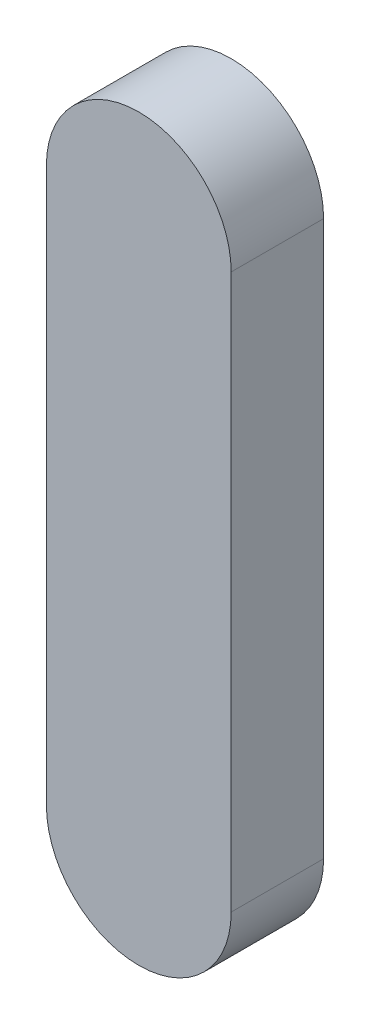
ISO-10303-21;
HEADER;
FILE_DESCRIPTION(('STEP AP214'),'2;1');
FILE_NAME('part.step','',(''),(''),'','','');
FILE_SCHEMA(('AUTOMOTIVE_DESIGN { 1 0 10303 214 1 1 1 1 }'));
ENDSEC;
DATA;
#1=APPLICATION_CONTEXT('core data for automotive mechanical design processes');
#2=APPLICATION_PROTOCOL_DEFINITION('international standard','automotive_design',2000,#1);
#3=PRODUCT_CONTEXT('',#1,'mechanical');
#4=PRODUCT('Part','Part','',(#3));
#5=PRODUCT_RELATED_PRODUCT_CATEGORY('part','',(#4));
#6=PRODUCT_DEFINITION_FORMATION('','',#4);
#7=PRODUCT_DEFINITION_CONTEXT('part definition',#1,'design');
#8=PRODUCT_DEFINITION('design','',#6,#7);
#9=PRODUCT_DEFINITION_SHAPE('','',#8);
#10=(LENGTH_UNIT() NAMED_UNIT(*) SI_UNIT(.MILLI.,.METRE.));
#11=(NAMED_UNIT(*) PLANE_ANGLE_UNIT() SI_UNIT($,.RADIAN.));
#12=(NAMED_UNIT(*) SI_UNIT($,.STERADIAN.) SOLID_ANGLE_UNIT());
#13=UNCERTAINTY_MEASURE_WITH_UNIT(LENGTH_MEASURE(1.E-05),#10,'distance_accuracy_value','');
#14=(GEOMETRIC_REPRESENTATION_CONTEXT(3) GLOBAL_UNCERTAINTY_ASSIGNED_CONTEXT((#13)) GLOBAL_UNIT_ASSIGNED_CONTEXT((#10,
#11,#12)) REPRESENTATION_CONTEXT('',''));
#15=CARTESIAN_POINT('',(0.,0.,0.));
#16=DIRECTION('',(0.,0.,1.));
#17=DIRECTION('',(1.,0.,0.));
#18=AXIS2_PLACEMENT_3D('',#15,#16,#17);
#19=CARTESIAN_POINT('',(0.,0.,5.));
#20=DIRECTION('',(0.,0.,-1.));
#21=DIRECTION('',(-1.,0.,0.));
#22=AXIS2_PLACEMENT_3D('',#19,#20,#21);
#23=CYLINDRICAL_SURFACE('',#22,5.);
#24=CARTESIAN_POINT('',(0.,0.,0.));
#25=DIRECTION('',(0.,0.,1.));
#26=DIRECTION('',(1.,0.,0.));
#27=AXIS2_PLACEMENT_3D('',#24,#25,#26);
#28=CIRCLE('',#27,5.);
#29=CARTESIAN_POINT('',(5.,0.,0.));
#30=VERTEX_POINT('',#29);
#31=CARTESIAN_POINT('',(-5.,0.,0.));
#32=VERTEX_POINT('',#31);
#33=EDGE_CURVE('E107',#30,#32,#28,.T.);
#34=ORIENTED_EDGE('',*,*,#33,.T.);
#35=DIRECTION('',(0.,0.,-1.));
#36=VECTOR('',#35,1.);
#37=CARTESIAN_POINT('',(-5.,0.,5.));
#38=LINE('',#37,#36);
#39=CARTESIAN_POINT('',(-5.,0.,5.));
#40=VERTEX_POINT('',#39);
#41=EDGE_CURVE('E11',#40,#32,#38,.T.);
#42=ORIENTED_EDGE('',*,*,#41,.F.);
#43=CARTESIAN_POINT('',(0.,0.,5.));
#44=DIRECTION('',(0.,0.,1.));
#45=DIRECTION('',(1.,0.,0.));
#46=AXIS2_PLACEMENT_3D('',#43,#44,#45);
#47=CIRCLE('',#46,5.);
#48=CARTESIAN_POINT('',(5.,0.,5.));
#49=VERTEX_POINT('',#48);
#50=EDGE_CURVE('E91',#49,#40,#47,.T.);
#51=ORIENTED_EDGE('',*,*,#50,.F.);
#52=DIRECTION('',(0.,0.,-1.));
#53=VECTOR('',#52,1.);
#54=CARTESIAN_POINT('',(5.,0.,5.));
#55=LINE('',#54,#53);
#56=EDGE_CURVE('E103',#49,#30,#55,.T.);
#57=ORIENTED_EDGE('',*,*,#56,.T.);
#58=EDGE_LOOP('',(#34,#42,#51,#57));
#59=FACE_BOUND('',#58,.T.);
#60=ADVANCED_FACE('F39',(#59),#23,.T.);
#61=CARTESIAN_POINT('',(-5.,0.,5.));
#62=DIRECTION('',(1.,0.,0.));
#63=DIRECTION('',(0.,1.,0.));
#64=AXIS2_PLACEMENT_3D('',#61,#62,#63);
#65=PLANE('',#64);
#66=DIRECTION('',(0.,-1.,0.));
#67=VECTOR('',#66,1.);
#68=CARTESIAN_POINT('',(-5.,0.,0.));
#69=LINE('',#68,#67);
#70=CARTESIAN_POINT('',(-5.,-30.,0.));
#71=VERTEX_POINT('',#70);
#72=EDGE_CURVE('E96',#32,#71,#69,.T.);
#73=ORIENTED_EDGE('',*,*,#72,.T.);
#74=DIRECTION('',(0.,0.,-1.));
#75=VECTOR('',#74,1.);
#76=CARTESIAN_POINT('',(-5.,-30.,5.));
#77=LINE('',#76,#75);
#78=CARTESIAN_POINT('',(-5.,-30.,5.));
#79=VERTEX_POINT('',#78);
#80=EDGE_CURVE('E48',#79,#71,#77,.T.);
#81=ORIENTED_EDGE('',*,*,#80,.F.);
#82=DIRECTION('',(0.,-1.,0.));
#83=VECTOR('',#82,1.);
#84=CARTESIAN_POINT('',(-5.,0.,5.));
#85=LINE('',#84,#83);
#86=EDGE_CURVE('E86',#40,#79,#85,.T.);
#87=ORIENTED_EDGE('',*,*,#86,.F.);
#88=ORIENTED_EDGE('',*,*,#41,.T.);
#89=EDGE_LOOP('',(#73,#81,#87,#88));
#90=FACE_BOUND('',#89,.T.);
#91=ADVANCED_FACE('F95',(#90),#65,.F.);
#92=CARTESIAN_POINT('',(0.,-30.,5.));
#93=DIRECTION('',(0.,0.,-1.));
#94=DIRECTION('',(-1.,0.,0.));
#95=AXIS2_PLACEMENT_3D('',#92,#93,#94);
#96=CYLINDRICAL_SURFACE('',#95,5.);
#97=CARTESIAN_POINT('',(0.,-30.,0.));
#98=DIRECTION('',(0.,0.,1.));
#99=DIRECTION('',(1.,0.,0.));
#100=AXIS2_PLACEMENT_3D('',#97,#98,#99);
#101=CIRCLE('',#100,5.);
#102=CARTESIAN_POINT('',(5.,-30.,0.));
#103=VERTEX_POINT('',#102);
#104=EDGE_CURVE('E73',#71,#103,#101,.T.);
#105=ORIENTED_EDGE('',*,*,#104,.T.);
#106=DIRECTION('',(0.,0.,-1.));
#107=VECTOR('',#106,1.);
#108=CARTESIAN_POINT('',(5.,-30.,5.));
#109=LINE('',#108,#107);
#110=CARTESIAN_POINT('',(5.,-30.,5.));
#111=VERTEX_POINT('',#110);
#112=EDGE_CURVE('E98',#111,#103,#109,.T.);
#113=ORIENTED_EDGE('',*,*,#112,.F.);
#114=CARTESIAN_POINT('',(0.,-30.,5.));
#115=DIRECTION('',(0.,0.,1.));
#116=DIRECTION('',(1.,0.,0.));
#117=AXIS2_PLACEMENT_3D('',#114,#115,#116);
#118=CIRCLE('',#117,5.);
#119=EDGE_CURVE('E89',#79,#111,#118,.T.);
#120=ORIENTED_EDGE('',*,*,#119,.F.);
#121=ORIENTED_EDGE('',*,*,#80,.T.);
#122=EDGE_LOOP('',(#105,#113,#120,#121));
#123=FACE_BOUND('',#122,.T.);
#124=ADVANCED_FACE('F99',(#123),#96,.T.);
#125=CARTESIAN_POINT('',(5.,0.,5.));
#126=DIRECTION('',(-1.,0.,0.));
#127=DIRECTION('',(0.,-1.,0.));
#128=AXIS2_PLACEMENT_3D('',#125,#126,#127);
#129=PLANE('',#128);
#130=DIRECTION('',(0.,1.,0.));
#131=VECTOR('',#130,1.);
#132=CARTESIAN_POINT('',(5.,0.,0.));
#133=LINE('',#132,#131);
#134=EDGE_CURVE('E79',#103,#30,#133,.T.);
#135=ORIENTED_EDGE('',*,*,#134,.T.);
#136=ORIENTED_EDGE('',*,*,#56,.F.);
#137=DIRECTION('',(0.,1.,0.));
#138=VECTOR('',#137,1.);
#139=CARTESIAN_POINT('',(5.,0.,5.));
#140=LINE('',#139,#138);
#141=EDGE_CURVE('E56',#111,#49,#140,.T.);
#142=ORIENTED_EDGE('',*,*,#141,.F.);
#143=ORIENTED_EDGE('',*,*,#112,.T.);
#144=EDGE_LOOP('',(#135,#136,#142,#143));
#145=FACE_BOUND('',#144,.T.);
#146=ADVANCED_FACE('F120',(#145),#129,.F.);
#147=CARTESIAN_POINT('',(0.,0.,5.));
#148=DIRECTION('',(0.,0.,1.));
#149=DIRECTION('',(1.,0.,0.));
#150=AXIS2_PLACEMENT_3D('',#147,#148,#149);
#151=PLANE('',#150);
#152=ORIENTED_EDGE('',*,*,#50,.T.);
#153=ORIENTED_EDGE('',*,*,#86,.T.);
#154=ORIENTED_EDGE('',*,*,#119,.T.);
#155=ORIENTED_EDGE('',*,*,#141,.T.);
#156=EDGE_LOOP('',(#152,#153,#154,#155));
#157=FACE_BOUND('',#156,.T.);
#158=ADVANCED_FACE('F87',(#157),#151,.T.);
#159=CARTESIAN_POINT('',(0.,0.,0.));
#160=DIRECTION('',(0.,0.,1.));
#161=DIRECTION('',(1.,0.,0.));
#162=AXIS2_PLACEMENT_3D('',#159,#160,#161);
#163=PLANE('',#162);
#164=ORIENTED_EDGE('',*,*,#33,.F.);
#165=ORIENTED_EDGE('',*,*,#134,.F.);
#166=ORIENTED_EDGE('',*,*,#104,.F.);
#167=ORIENTED_EDGE('',*,*,#72,.F.);
#168=EDGE_LOOP('',(#164,#165,#166,#167));
#169=FACE_BOUND('',#168,.T.);
#170=ADVANCED_FACE('F123',(#169),#163,.F.);
#171=CLOSED_SHELL('',(#60,#91,#124,#146,#158,#170));
#172=MANIFOLD_SOLID_BREP('B2',#171);
#173=ADVANCED_BREP_SHAPE_REPRESENTATION('',(#18,#172),#14);
#174=SHAPE_DEFINITION_REPRESENTATION(#9,#173);
ENDSEC;
END-ISO-10303-21;
